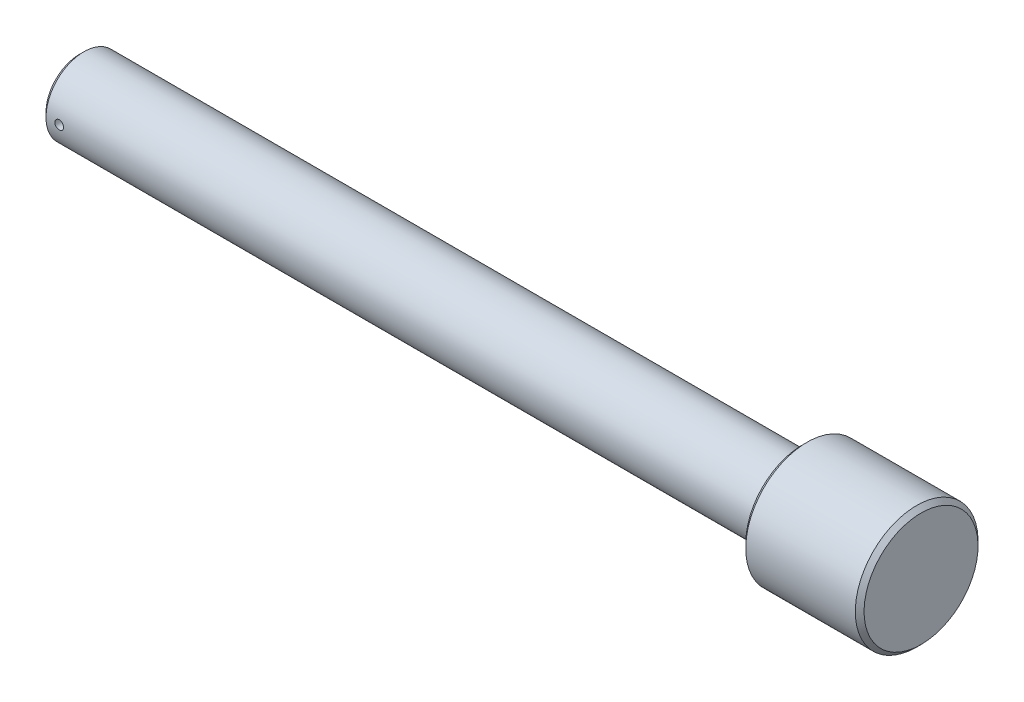
ISO-10303-21;
HEADER;
FILE_DESCRIPTION(('STEP AP214'),'2;1');
FILE_NAME('part.step','',(''),(''),'','','');
FILE_SCHEMA(('AUTOMOTIVE_DESIGN { 1 0 10303 214 1 1 1 1 }'));
ENDSEC;
DATA;
#1=APPLICATION_CONTEXT('core data for automotive mechanical design processes');
#2=APPLICATION_PROTOCOL_DEFINITION('international standard','automotive_design',2000,#1);
#3=PRODUCT_CONTEXT('',#1,'mechanical');
#4=PRODUCT('Part','Part','',(#3));
#5=PRODUCT_RELATED_PRODUCT_CATEGORY('part','',(#4));
#6=PRODUCT_DEFINITION_FORMATION('','',#4);
#7=PRODUCT_DEFINITION_CONTEXT('part definition',#1,'design');
#8=PRODUCT_DEFINITION('design','',#6,#7);
#9=PRODUCT_DEFINITION_SHAPE('','',#8);
#10=(LENGTH_UNIT() NAMED_UNIT(*) SI_UNIT(.MILLI.,.METRE.));
#11=(NAMED_UNIT(*) PLANE_ANGLE_UNIT() SI_UNIT($,.RADIAN.));
#12=(NAMED_UNIT(*) SI_UNIT($,.STERADIAN.) SOLID_ANGLE_UNIT());
#13=UNCERTAINTY_MEASURE_WITH_UNIT(LENGTH_MEASURE(1.E-05),#10,'distance_accuracy_value','');
#14=(GEOMETRIC_REPRESENTATION_CONTEXT(3) GLOBAL_UNCERTAINTY_ASSIGNED_CONTEXT((#13)) GLOBAL_UNIT_ASSIGNED_CONTEXT((#10,
#11,#12)) REPRESENTATION_CONTEXT('',''));
#15=CARTESIAN_POINT('',(0.,0.,0.));
#16=DIRECTION('',(0.,0.,1.));
#17=DIRECTION('',(1.,0.,0.));
#18=AXIS2_PLACEMENT_3D('',#15,#16,#17);
#19=CARTESIAN_POINT('',(0.,0.,0.));
#20=DIRECTION('',(1.,0.,0.));
#21=DIRECTION('',(0.,1.,0.));
#22=AXIS2_PLACEMENT_3D('',#19,#20,#21);
#23=PLANE('',#22);
#24=CARTESIAN_POINT('',(0.,0.,0.));
#25=DIRECTION('',(-1.,0.,0.));
#26=DIRECTION('',(0.,-1.,0.));
#27=AXIS2_PLACEMENT_3D('',#24,#25,#26);
#28=CIRCLE('',#27,7.65);
#29=CARTESIAN_POINT('',(0.,-7.65,0.));
#30=VERTEX_POINT('',#29);
#31=EDGE_CURVE('E10',#30,#30,#28,.T.);
#32=ORIENTED_EDGE('',*,*,#31,.T.);
#33=EDGE_LOOP('',(#32));
#34=FACE_BOUND('',#33,.T.);
#35=ADVANCED_FACE('F33',(#34),#23,.F.);
#36=CARTESIAN_POINT('',(1.,0.,0.));
#37=DIRECTION('',(1.,0.,0.));
#38=DIRECTION('',(0.,1.,0.));
#39=AXIS2_PLACEMENT_3D('',#36,#37,#38);
#40=CONICAL_SURFACE('',#39,8.65,0.785398163397448);
#41=ORIENTED_EDGE('',*,*,#31,.F.);
#42=EDGE_LOOP('',(#41));
#43=FACE_BOUND('',#42,.T.);
#44=CARTESIAN_POINT('',(1.,0.,0.));
#45=DIRECTION('',(-1.,0.,0.));
#46=DIRECTION('',(0.,-1.,0.));
#47=AXIS2_PLACEMENT_3D('',#44,#45,#46);
#48=CIRCLE('',#47,8.65);
#49=CARTESIAN_POINT('',(1.,-8.65,0.));
#50=VERTEX_POINT('',#49);
#51=EDGE_CURVE('E44',#50,#50,#48,.T.);
#52=ORIENTED_EDGE('',*,*,#51,.T.);
#53=EDGE_LOOP('',(#52));
#54=FACE_BOUND('',#53,.T.);
#55=ADVANCED_FACE('F86',(#43,#54),#40,.T.);
#56=CARTESIAN_POINT('',(0.,0.,0.));
#57=DIRECTION('',(-1.,0.,0.));
#58=DIRECTION('',(0.,-1.,0.));
#59=AXIS2_PLACEMENT_3D('',#56,#57,#58);
#60=CYLINDRICAL_SURFACE('',#59,8.65);
#61=CARTESIAN_POINT('',(5.,0.,-8.65));
#62=CARTESIAN_POINT('',(4.99999760257165,0.0559701106863908,-8.64999926844503));
#63=CARTESIAN_POINT('',(4.99528518546289,0.111976012812566,-8.64945101395445));
#64=CARTESIAN_POINT('',(4.97655951185623,0.222431672601842,-8.64731664703321));
#65=CARTESIAN_POINT('',(4.96253632864735,0.276879704639297,-8.64572942693067));
#66=CARTESIAN_POINT('',(4.92560581129129,0.382604383236855,-8.64169608232959));
#67=CARTESIAN_POINT('',(4.90270421161981,0.433883052119059,-8.63925051232652));
#68=CARTESIAN_POINT('',(4.84867895096369,0.531858640924465,-8.6337730498969));
#69=CARTESIAN_POINT('',(4.81755679012565,0.578556394675621,-8.63074126447414));
#70=CARTESIAN_POINT('',(4.74781587772401,0.666276310948242,-8.62441424329056));
#71=CARTESIAN_POINT('',(4.70916599182473,0.707273646422806,-8.6211179480193));
#72=CARTESIAN_POINT('',(4.62553347699146,0.782215302162732,-8.61464204901954));
#73=CARTESIAN_POINT('',(4.58055053787755,0.816159276767252,-8.61146245101626));
#74=CARTESIAN_POINT('',(4.4853696404974,0.876121491300773,-8.60556940204058));
#75=CARTESIAN_POINT('',(4.43515712116476,0.902116762961432,-8.60285731162958));
#76=CARTESIAN_POINT('',(4.33104285368704,0.945296996474737,-8.59822005013255));
#77=CARTESIAN_POINT('',(4.27714122577813,0.962482245310576,-8.59629485341418));
#78=CARTESIAN_POINT('',(4.16743494243928,0.987479829863625,-8.59345930113022));
#79=CARTESIAN_POINT('',(4.11163989887766,0.995333828617248,-8.59254443584363));
#80=CARTESIAN_POINT('',(3.99951670529727,1.00157483463262,-8.59181926483518));
#81=CARTESIAN_POINT('',(3.94318857379253,0.999962169474023,-8.59200892089302));
#82=CARTESIAN_POINT('',(3.83188723442011,0.987349879647738,-8.59346723868672));
#83=CARTESIAN_POINT('',(3.77690876592329,0.97639598532988,-8.59473064374068));
#84=CARTESIAN_POINT('',(3.66957571079721,0.945483450403423,-8.5981859046304));
#85=CARTESIAN_POINT('',(3.61722117028417,0.925524651592947,-8.60037777677781));
#86=CARTESIAN_POINT('',(3.51647909577491,0.877119181505179,-8.60544900370984));
#87=CARTESIAN_POINT('',(3.46810127529053,0.84865247096163,-8.60832997834953));
#88=CARTESIAN_POINT('',(3.37679228936829,0.784053602725151,-8.61445350398139));
#89=CARTESIAN_POINT('',(3.33386133722922,0.747921144990328,-8.61769606912408));
#90=CARTESIAN_POINT('',(3.25439918319201,0.668762217301649,-8.62420081786374));
#91=CARTESIAN_POINT('',(3.21790726777226,0.625696299052344,-8.62746300424534));
#92=CARTESIAN_POINT('',(3.15266439072346,0.534029220155929,-8.63362145535457));
#93=CARTESIAN_POINT('',(3.12391344283435,0.485428049684159,-8.6365177194327));
#94=CARTESIAN_POINT('',(3.07496925148052,0.384041013189048,-8.64161943557529));
#95=CARTESIAN_POINT('',(3.05477828046257,0.331254040355591,-8.64382470415829));
#96=CARTESIAN_POINT('',(3.0235574136128,0.223007897142049,-8.64729422161543));
#97=CARTESIAN_POINT('',(3.0125271512375,0.16754883377312,-8.64855850814047));
#98=CARTESIAN_POINT('',(2.99999129520244,0.0558726900063936,-8.64999874186478));
#99=CARTESIAN_POINT('',(2.99843154533211,-0.000338234667912451,-8.65018087711273));
#100=CARTESIAN_POINT('',(3.00473834347673,-0.112220670105072,-8.64945294828845));
#101=CARTESIAN_POINT('',(3.01260472036214,-0.167892190642207,-8.64854290404454));
#102=CARTESIAN_POINT('',(3.03749550706064,-0.276957109927673,-8.64573676040664));
#103=CARTESIAN_POINT('',(3.05449428087891,-0.330356436382181,-8.6438434217593));
#104=CARTESIAN_POINT('',(3.09714079971655,-0.433546125944152,-8.6392828254238));
#105=CARTESIAN_POINT('',(3.12278879917285,-0.483336382830144,-8.63661554496869));
#106=CARTESIAN_POINT('',(3.18213805917121,-0.578137642259629,-8.63078938358659));
#107=CARTESIAN_POINT('',(3.2158745725432,-0.623126442057443,-8.62762837241771));
#108=CARTESIAN_POINT('',(3.29039306314978,-0.706822287719471,-8.62117553910158));
#109=CARTESIAN_POINT('',(3.33117527834152,-0.745529121334795,-8.61788371253916));
#110=CARTESIAN_POINT('',(3.41886518083518,-0.815752793686234,-8.61152135106737));
#111=CARTESIAN_POINT('',(3.46580159940624,-0.847233874192696,-8.60845196606036));
#112=CARTESIAN_POINT('',(3.56432722449077,-0.901865866179685,-8.60290039514755));
#113=CARTESIAN_POINT('',(3.61591634930563,-0.925016923894612,-8.60041819893386));
#114=CARTESIAN_POINT('',(3.72216467945126,-0.962273009493356,-8.59632965343057));
#115=CARTESIAN_POINT('',(3.77681657893094,-0.976398644433537,-8.59472131020606));
#116=CARTESIAN_POINT('',(3.88773626403166,-0.995269483030389,-8.59255668258121));
#117=CARTESIAN_POINT('',(3.94400398607702,-1.00001505524066,-8.59200035684592));
#118=CARTESIAN_POINT('',(4.05620249193161,-0.999984961317694,-8.59200383125403));
#119=CARTESIAN_POINT('',(4.11213329939079,-0.995265467086352,-8.59255704665475));
#120=CARTESIAN_POINT('',(4.22240136305212,-0.976557689189247,-8.59470316099543));
#121=CARTESIAN_POINT('',(4.27673861836386,-0.962569400344625,-8.5962960605163));
#122=CARTESIAN_POINT('',(4.38227250720511,-0.92573786715434,-8.60034011243399));
#123=CARTESIAN_POINT('',(4.43346994898184,-0.902896912827547,-8.60279104285842));
#124=CARTESIAN_POINT('',(4.53131403657673,-0.849014004203374,-8.60827540124824));
#125=CARTESIAN_POINT('',(4.57796065819299,-0.817972006294991,-8.6113088323112));
#126=CARTESIAN_POINT('',(4.66566652728011,-0.748358586402144,-8.6176379861936));
#127=CARTESIAN_POINT('',(4.70669242084782,-0.709745266604238,-8.62093510515972));
#128=CARTESIAN_POINT('',(4.78170484460964,-0.626171489845107,-8.62740760995668));
#129=CARTESIAN_POINT('',(4.8156897029154,-0.581209529656164,-8.63058296672964));
#130=CARTESIAN_POINT('',(4.87574774743657,-0.486048355120413,-8.63646543826371));
#131=CARTESIAN_POINT('',(4.90179465846308,-0.435832471039328,-8.63917098547731));
#132=CARTESIAN_POINT('',(4.94505013611488,-0.331737927073906,-8.64379275658139));
#133=CARTESIAN_POINT('',(4.96226845221479,-0.277863382278922,-8.64570985070054));
#134=CARTESIAN_POINT('',(4.98318702748133,-0.186416006485789,-8.64806867154156));
#135=CARTESIAN_POINT('',(4.98948301231598,-0.149423213479216,-8.64878945247469));
#136=CARTESIAN_POINT('',(4.99789028893673,-0.0749589637724293,-8.6497553602714));
#137=CARTESIAN_POINT('',(5.0000016057431,-0.0374875099354936,-8.65000048997892));
#138=CARTESIAN_POINT('',(5.,0.,-8.65));
#139=B_SPLINE_CURVE_WITH_KNOTS('',3,(#61,#62,#63,#64,#65,#66,#67,#68,#69,#70,#71,#72,#73,#74,
#75,#76,#77,#78,#79,#80,#81,#82,#83,#84,#85,#86,#87,#88,#89,#90,#91,#92,#93,#94,#95,#96,#97,#98,
#99,#100,#101,#102,#103,#104,#105,#106,#107,#108,#109,#110,#111,#112,#113,#114,#115,#116,#117,
#118,#119,#120,#121,#122,#123,#124,#125,#126,#127,#128,#129,#130,#131,#132,#133,#134,#135,#136,
#137,#138),.UNSPECIFIED.,.T.,.F.,(4,2,2,2,2,2,2,2,2,2,2,2,2,2,2,2,2,2,2,2,2,2,2,2,2,2,2,2,2,2,2,
2,2,2,2,2,2,2,4),(0.,0.167773418306292,0.335725996765916,0.503570276671042,0.671383948291182,
0.839907022189024,1.00843835287362,1.17745216092668,1.34646046306838,1.51471129085057,
1.68295629660064,1.85038234981168,2.01781134454725,2.18563784648344,2.35347091846079,
2.52229502025291,2.69111942169989,2.85998861352449,3.02885104813363,3.19674694283735,
3.36463978946927,3.53206377990225,3.69949269592819,3.86766503838573,4.03584306170246,
4.20483622097862,4.37382641341786,4.54242937154981,4.71102570494325,4.87862443813347,
5.0462232649681,5.21377876602815,5.38133515812241,5.54984635663603,5.71839752226013,
5.88750069199804,6.05641671562921,6.16878821558636,6.28115904366832),.UNSPECIFIED.);
#140=CARTESIAN_POINT('',(5.,0.,-8.65));
#141=VERTEX_POINT('',#140);
#142=EDGE_CURVE('E36',#141,#141,#139,.T.);
#143=ORIENTED_EDGE('',*,*,#142,.T.);
#144=EDGE_LOOP('',(#143));
#145=FACE_BOUND('',#144,.T.);
#146=CARTESIAN_POINT('',(5.,0.,8.65));
#147=CARTESIAN_POINT('',(4.99999760257165,-0.0559701106863908,8.64999926844503));
#148=CARTESIAN_POINT('',(4.99528518546289,-0.111976012812566,8.64945101395445));
#149=CARTESIAN_POINT('',(4.97655951185623,-0.222431672601842,8.64731664703321));
#150=CARTESIAN_POINT('',(4.96253632864735,-0.276879704639297,8.64572942693067));
#151=CARTESIAN_POINT('',(4.92560581129129,-0.382604383236855,8.64169608232959));
#152=CARTESIAN_POINT('',(4.90270421161981,-0.433883052119059,8.63925051232652));
#153=CARTESIAN_POINT('',(4.84867895096369,-0.531858640924465,8.6337730498969));
#154=CARTESIAN_POINT('',(4.81755679012565,-0.578556394675621,8.63074126447414));
#155=CARTESIAN_POINT('',(4.74781587772401,-0.666276310948242,8.62441424329056));
#156=CARTESIAN_POINT('',(4.70916599182473,-0.707273646422806,8.6211179480193));
#157=CARTESIAN_POINT('',(4.62553347699146,-0.782215302162732,8.61464204901954));
#158=CARTESIAN_POINT('',(4.58055053787755,-0.816159276767252,8.61146245101626));
#159=CARTESIAN_POINT('',(4.4853696404974,-0.876121491300773,8.60556940204058));
#160=CARTESIAN_POINT('',(4.43515712116476,-0.902116762961432,8.60285731162958));
#161=CARTESIAN_POINT('',(4.33104285368704,-0.945296996474737,8.59822005013255));
#162=CARTESIAN_POINT('',(4.27714122577813,-0.962482245310576,8.59629485341418));
#163=CARTESIAN_POINT('',(4.16743494243928,-0.987479829863625,8.59345930113022));
#164=CARTESIAN_POINT('',(4.11163989887766,-0.995333828617248,8.59254443584363));
#165=CARTESIAN_POINT('',(3.99951670529727,-1.00157483463262,8.59181926483518));
#166=CARTESIAN_POINT('',(3.94318857379253,-0.999962169474023,8.59200892089302));
#167=CARTESIAN_POINT('',(3.83188723442011,-0.987349879647738,8.59346723868672));
#168=CARTESIAN_POINT('',(3.77690876592329,-0.97639598532988,8.59473064374068));
#169=CARTESIAN_POINT('',(3.66957571079721,-0.945483450403423,8.5981859046304));
#170=CARTESIAN_POINT('',(3.61722117028417,-0.925524651592947,8.60037777677781));
#171=CARTESIAN_POINT('',(3.51647909577491,-0.877119181505179,8.60544900370984));
#172=CARTESIAN_POINT('',(3.46810127529053,-0.84865247096163,8.60832997834953));
#173=CARTESIAN_POINT('',(3.37679228936829,-0.784053602725151,8.61445350398139));
#174=CARTESIAN_POINT('',(3.33386133722922,-0.747921144990328,8.61769606912408));
#175=CARTESIAN_POINT('',(3.25439918319201,-0.668762217301649,8.62420081786374));
#176=CARTESIAN_POINT('',(3.21790726777226,-0.625696299052344,8.62746300424534));
#177=CARTESIAN_POINT('',(3.15266439072346,-0.534029220155929,8.63362145535457));
#178=CARTESIAN_POINT('',(3.12391344283435,-0.485428049684159,8.6365177194327));
#179=CARTESIAN_POINT('',(3.07496925148052,-0.384041013189048,8.64161943557529));
#180=CARTESIAN_POINT('',(3.05477828046257,-0.331254040355591,8.64382470415829));
#181=CARTESIAN_POINT('',(3.0235574136128,-0.223007897142049,8.64729422161543));
#182=CARTESIAN_POINT('',(3.0125271512375,-0.16754883377312,8.64855850814047));
#183=CARTESIAN_POINT('',(2.99999129520244,-0.0558726900063936,8.64999874186478));
#184=CARTESIAN_POINT('',(2.99843154533211,0.000338234667912451,8.65018087711273));
#185=CARTESIAN_POINT('',(3.00473834347673,0.112220670105072,8.64945294828845));
#186=CARTESIAN_POINT('',(3.01260472036214,0.167892190642207,8.64854290404454));
#187=CARTESIAN_POINT('',(3.03749550706064,0.276957109927673,8.64573676040664));
#188=CARTESIAN_POINT('',(3.05449428087891,0.330356436382181,8.6438434217593));
#189=CARTESIAN_POINT('',(3.09714079971655,0.433546125944152,8.6392828254238));
#190=CARTESIAN_POINT('',(3.12278879917285,0.483336382830144,8.63661554496869));
#191=CARTESIAN_POINT('',(3.18213805917121,0.578137642259629,8.63078938358659));
#192=CARTESIAN_POINT('',(3.2158745725432,0.623126442057443,8.62762837241771));
#193=CARTESIAN_POINT('',(3.29039306314978,0.706822287719471,8.62117553910158));
#194=CARTESIAN_POINT('',(3.33117527834152,0.745529121334795,8.61788371253916));
#195=CARTESIAN_POINT('',(3.41886518083518,0.815752793686234,8.61152135106737));
#196=CARTESIAN_POINT('',(3.46580159940624,0.847233874192696,8.60845196606036));
#197=CARTESIAN_POINT('',(3.56432722449077,0.901865866179685,8.60290039514755));
#198=CARTESIAN_POINT('',(3.61591634930563,0.925016923894612,8.60041819893386));
#199=CARTESIAN_POINT('',(3.72216467945126,0.962273009493356,8.59632965343057));
#200=CARTESIAN_POINT('',(3.77681657893094,0.976398644433537,8.59472131020606));
#201=CARTESIAN_POINT('',(3.88773626403166,0.995269483030389,8.59255668258121));
#202=CARTESIAN_POINT('',(3.94400398607702,1.00001505524066,8.59200035684592));
#203=CARTESIAN_POINT('',(4.05620249193161,0.999984961317694,8.59200383125403));
#204=CARTESIAN_POINT('',(4.11213329939079,0.995265467086352,8.59255704665475));
#205=CARTESIAN_POINT('',(4.22240136305212,0.976557689189247,8.59470316099543));
#206=CARTESIAN_POINT('',(4.27673861836386,0.962569400344625,8.5962960605163));
#207=CARTESIAN_POINT('',(4.38227250720511,0.92573786715434,8.60034011243399));
#208=CARTESIAN_POINT('',(4.43346994898184,0.902896912827547,8.60279104285842));
#209=CARTESIAN_POINT('',(4.53131403657673,0.849014004203374,8.60827540124824));
#210=CARTESIAN_POINT('',(4.57796065819299,0.817972006294991,8.6113088323112));
#211=CARTESIAN_POINT('',(4.66566652728011,0.748358586402144,8.6176379861936));
#212=CARTESIAN_POINT('',(4.70669242084782,0.709745266604238,8.62093510515972));
#213=CARTESIAN_POINT('',(4.78170484460964,0.626171489845107,8.62740760995668));
#214=CARTESIAN_POINT('',(4.8156897029154,0.581209529656164,8.63058296672964));
#215=CARTESIAN_POINT('',(4.87574774743657,0.486048355120413,8.63646543826371));
#216=CARTESIAN_POINT('',(4.90179465846308,0.435832471039328,8.63917098547731));
#217=CARTESIAN_POINT('',(4.94505013611488,0.331737927073906,8.64379275658139));
#218=CARTESIAN_POINT('',(4.96226845221479,0.277863382278922,8.64570985070054));
#219=CARTESIAN_POINT('',(4.98318702748133,0.186416006485789,8.64806867154156));
#220=CARTESIAN_POINT('',(4.98948301231598,0.149423213479216,8.64878945247469));
#221=CARTESIAN_POINT('',(4.99789028893673,0.0749589637724293,8.6497553602714));
#222=CARTESIAN_POINT('',(5.0000016057431,0.0374875099354936,8.65000048997892));
#223=CARTESIAN_POINT('',(5.,0.,8.65));
#224=B_SPLINE_CURVE_WITH_KNOTS('',3,(#146,#147,#148,#149,#150,#151,#152,#153,#154,#155,#156,
#157,#158,#159,#160,#161,#162,#163,#164,#165,#166,#167,#168,#169,#170,#171,#172,#173,#174,#175,
#176,#177,#178,#179,#180,#181,#182,#183,#184,#185,#186,#187,#188,#189,#190,#191,#192,#193,#194,
#195,#196,#197,#198,#199,#200,#201,#202,#203,#204,#205,#206,#207,#208,#209,#210,#211,#212,#213,
#214,#215,#216,#217,#218,#219,#220,#221,#222,#223),.UNSPECIFIED.,.T.,.F.,(4,2,2,2,2,2,2,2,2,2,2,
2,2,2,2,2,2,2,2,2,2,2,2,2,2,2,2,2,2,2,2,2,2,2,2,2,2,2,4),(0.,0.167773418306292,
0.335725996765916,0.503570276671042,0.671383948291182,0.839907022189024,1.00843835287362,
1.17745216092668,1.34646046306838,1.51471129085057,1.68295629660064,1.85038234981168,
2.01781134454725,2.18563784648344,2.35347091846079,2.52229502025291,2.69111942169989,
2.85998861352449,3.02885104813363,3.19674694283735,3.36463978946927,3.53206377990225,
3.69949269592819,3.86766503838573,4.03584306170246,4.20483622097862,4.37382641341786,
4.54242937154981,4.71102570494325,4.87862443813347,5.0462232649681,5.21377876602815,
5.38133515812241,5.54984635663603,5.71839752226013,5.88750069199804,6.05641671562921,
6.16878821558636,6.28115904366832),.UNSPECIFIED.);
#225=CARTESIAN_POINT('',(5.,0.,8.65));
#226=VERTEX_POINT('',#225);
#227=EDGE_CURVE('E52',#226,#226,#224,.T.);
#228=ORIENTED_EDGE('',*,*,#227,.T.);
#229=EDGE_LOOP('',(#228));
#230=FACE_BOUND('',#229,.T.);
#231=ORIENTED_EDGE('',*,*,#51,.F.);
#232=EDGE_LOOP('',(#231));
#233=FACE_BOUND('',#232,.T.);
#234=CARTESIAN_POINT('',(165.,0.,0.));
#235=DIRECTION('',(-1.,0.,0.));
#236=DIRECTION('',(0.,-1.,0.));
#237=AXIS2_PLACEMENT_3D('',#234,#235,#236);
#238=CIRCLE('',#237,8.65);
#239=CARTESIAN_POINT('',(165.,-8.65,0.));
#240=VERTEX_POINT('',#239);
#241=EDGE_CURVE('E49',#240,#240,#238,.T.);
#242=ORIENTED_EDGE('',*,*,#241,.T.);
#243=EDGE_LOOP('',(#242));
#244=FACE_BOUND('',#243,.T.);
#245=ADVANCED_FACE('F56',(#145,#230,#233,#244),#60,.T.);
#246=CARTESIAN_POINT('',(165.,8.65,0.));
#247=DIRECTION('',(1.,0.,0.));
#248=DIRECTION('',(0.,1.,0.));
#249=AXIS2_PLACEMENT_3D('',#246,#247,#248);
#250=PLANE('',#249);
#251=ORIENTED_EDGE('',*,*,#241,.F.);
#252=EDGE_LOOP('',(#251));
#253=FACE_BOUND('',#252,.T.);
#254=CARTESIAN_POINT('',(165.,0.,0.));
#255=DIRECTION('',(-1.,0.,0.));
#256=DIRECTION('',(0.,-1.,0.));
#257=AXIS2_PLACEMENT_3D('',#254,#255,#256);
#258=CIRCLE('',#257,13.);
#259=CARTESIAN_POINT('',(165.,-13.,0.));
#260=VERTEX_POINT('',#259);
#261=EDGE_CURVE('E102',#260,#260,#258,.T.);
#262=ORIENTED_EDGE('',*,*,#261,.T.);
#263=EDGE_LOOP('',(#262));
#264=FACE_BOUND('',#263,.T.);
#265=ADVANCED_FACE('F79',(#253,#264),#250,.F.);
#266=CARTESIAN_POINT('',(166.,0.,0.));
#267=DIRECTION('',(1.,0.,0.));
#268=DIRECTION('',(0.,1.,0.));
#269=AXIS2_PLACEMENT_3D('',#266,#267,#268);
#270=CONICAL_SURFACE('',#269,14.,0.785398163397461);
#271=ORIENTED_EDGE('',*,*,#261,.F.);
#272=EDGE_LOOP('',(#271));
#273=FACE_BOUND('',#272,.T.);
#274=CARTESIAN_POINT('',(166.,0.,0.));
#275=DIRECTION('',(-1.,0.,0.));
#276=DIRECTION('',(0.,-1.,0.));
#277=AXIS2_PLACEMENT_3D('',#274,#275,#276);
#278=CIRCLE('',#277,14.);
#279=CARTESIAN_POINT('',(166.,-14.,0.));
#280=VERTEX_POINT('',#279);
#281=EDGE_CURVE('E104',#280,#280,#278,.T.);
#282=ORIENTED_EDGE('',*,*,#281,.T.);
#283=EDGE_LOOP('',(#282));
#284=FACE_BOUND('',#283,.T.);
#285=ADVANCED_FACE('F76',(#273,#284),#270,.T.);
#286=CARTESIAN_POINT('',(0.,0.,0.));
#287=DIRECTION('',(-1.,0.,0.));
#288=DIRECTION('',(0.,-1.,0.));
#289=AXIS2_PLACEMENT_3D('',#286,#287,#288);
#290=CYLINDRICAL_SURFACE('',#289,14.);
#291=ORIENTED_EDGE('',*,*,#281,.F.);
#292=EDGE_LOOP('',(#291));
#293=FACE_BOUND('',#292,.T.);
#294=CARTESIAN_POINT('',(191.,0.,0.));
#295=DIRECTION('',(-1.,0.,0.));
#296=DIRECTION('',(0.,-1.,0.));
#297=AXIS2_PLACEMENT_3D('',#294,#295,#296);
#298=CIRCLE('',#297,14.);
#299=CARTESIAN_POINT('',(191.,-14.,0.));
#300=VERTEX_POINT('',#299);
#301=EDGE_CURVE('E109',#300,#300,#298,.T.);
#302=ORIENTED_EDGE('',*,*,#301,.T.);
#303=EDGE_LOOP('',(#302));
#304=FACE_BOUND('',#303,.T.);
#305=ADVANCED_FACE('F72',(#293,#304),#290,.T.);
#306=CARTESIAN_POINT('',(192.,0.,0.));
#307=DIRECTION('',(-1.,0.,0.));
#308=DIRECTION('',(0.,-1.,0.));
#309=AXIS2_PLACEMENT_3D('',#306,#307,#308);
#310=CONICAL_SURFACE('',#309,13.,0.785398163397434);
#311=ORIENTED_EDGE('',*,*,#301,.F.);
#312=EDGE_LOOP('',(#311));
#313=FACE_BOUND('',#312,.T.);
#314=CARTESIAN_POINT('',(192.,0.,0.));
#315=DIRECTION('',(-1.,0.,0.));
#316=DIRECTION('',(0.,-1.,0.));
#317=AXIS2_PLACEMENT_3D('',#314,#315,#316);
#318=CIRCLE('',#317,13.);
#319=CARTESIAN_POINT('',(192.,-13.,0.));
#320=VERTEX_POINT('',#319);
#321=EDGE_CURVE('E112',#320,#320,#318,.T.);
#322=ORIENTED_EDGE('',*,*,#321,.T.);
#323=EDGE_LOOP('',(#322));
#324=FACE_BOUND('',#323,.T.);
#325=ADVANCED_FACE('F68',(#313,#324),#310,.T.);
#326=CARTESIAN_POINT('',(192.,13.,0.));
#327=DIRECTION('',(-1.,0.,0.));
#328=DIRECTION('',(0.,-1.,0.));
#329=AXIS2_PLACEMENT_3D('',#326,#327,#328);
#330=PLANE('',#329);
#331=ORIENTED_EDGE('',*,*,#321,.F.);
#332=EDGE_LOOP('',(#331));
#333=FACE_BOUND('',#332,.T.);
#334=ADVANCED_FACE('F63',(#333),#330,.F.);
#335=CARTESIAN_POINT('',(4.,0.,-14.));
#336=DIRECTION('',(0.,0.,1.));
#337=DIRECTION('',(1.,0.,0.));
#338=AXIS2_PLACEMENT_3D('',#335,#336,#337);
#339=CYLINDRICAL_SURFACE('',#338,1.);
#340=ORIENTED_EDGE('',*,*,#227,.F.);
#341=EDGE_LOOP('',(#340));
#342=FACE_BOUND('',#341,.T.);
#343=ORIENTED_EDGE('',*,*,#142,.F.);
#344=EDGE_LOOP('',(#343));
#345=FACE_BOUND('',#344,.T.);
#346=ADVANCED_FACE('F59',(#342,#345),#339,.F.);
#347=CLOSED_SHELL('',(#35,#55,#245,#265,#285,#305,#325,#334,#346));
#348=MANIFOLD_SOLID_BREP('B2',#347);
#349=ADVANCED_BREP_SHAPE_REPRESENTATION('',(#18,#348),#14);
#350=SHAPE_DEFINITION_REPRESENTATION(#9,#349);
ENDSEC;
END-ISO-10303-21;
